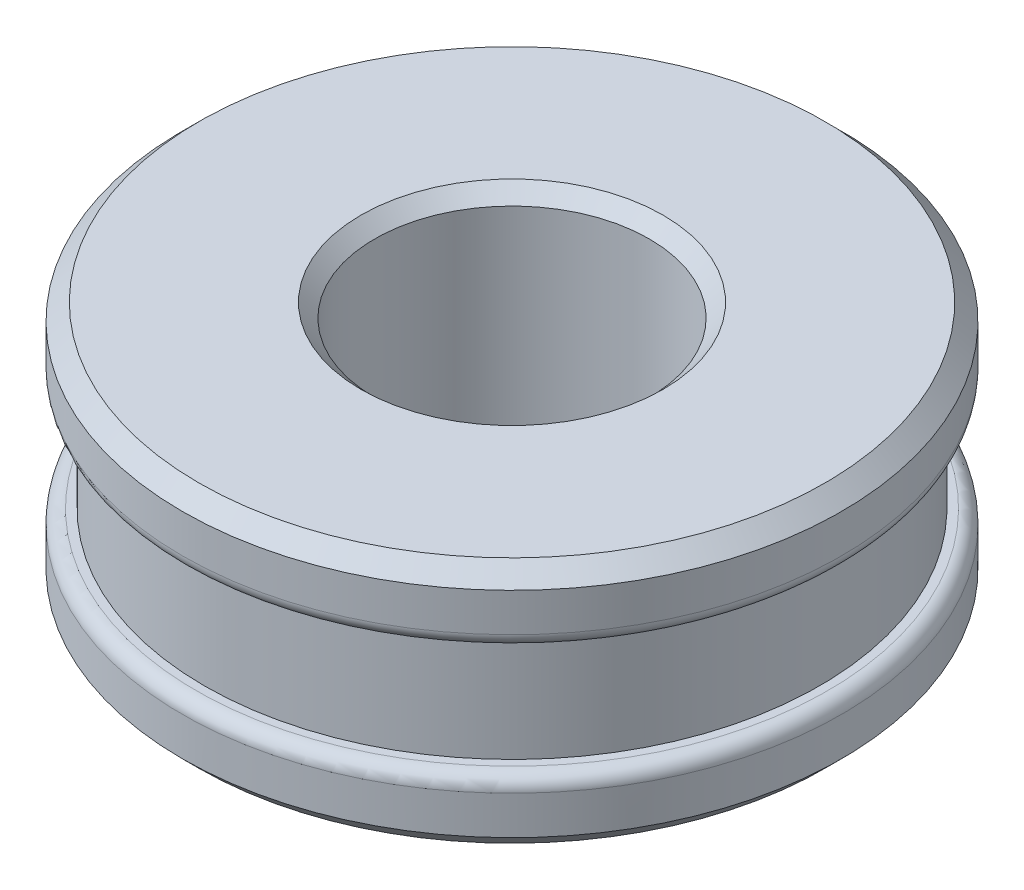
ISO-10303-21;
HEADER;
FILE_DESCRIPTION(('STEP AP214'),'2;1');
FILE_NAME('part.step','',(''),(''),'','','');
FILE_SCHEMA(('AUTOMOTIVE_DESIGN { 1 0 10303 214 1 1 1 1 }'));
ENDSEC;
DATA;
#1=APPLICATION_CONTEXT('core data for automotive mechanical design processes');
#2=APPLICATION_PROTOCOL_DEFINITION('international standard','automotive_design',2000,#1);
#3=PRODUCT_CONTEXT('',#1,'mechanical');
#4=PRODUCT('Part','Part','',(#3));
#5=PRODUCT_RELATED_PRODUCT_CATEGORY('part','',(#4));
#6=PRODUCT_DEFINITION_FORMATION('','',#4);
#7=PRODUCT_DEFINITION_CONTEXT('part definition',#1,'design');
#8=PRODUCT_DEFINITION('design','',#6,#7);
#9=PRODUCT_DEFINITION_SHAPE('','',#8);
#10=(LENGTH_UNIT() NAMED_UNIT(*) SI_UNIT(.MILLI.,.METRE.));
#11=(NAMED_UNIT(*) PLANE_ANGLE_UNIT() SI_UNIT($,.RADIAN.));
#12=(NAMED_UNIT(*) SI_UNIT($,.STERADIAN.) SOLID_ANGLE_UNIT());
#13=UNCERTAINTY_MEASURE_WITH_UNIT(LENGTH_MEASURE(1.E-05),#10,'distance_accuracy_value','');
#14=(GEOMETRIC_REPRESENTATION_CONTEXT(3) GLOBAL_UNCERTAINTY_ASSIGNED_CONTEXT((#13)) GLOBAL_UNIT_ASSIGNED_CONTEXT((#10,
#11,#12)) REPRESENTATION_CONTEXT('',''));
#15=CARTESIAN_POINT('',(0.,0.,0.));
#16=DIRECTION('',(0.,0.,1.));
#17=DIRECTION('',(1.,0.,0.));
#18=AXIS2_PLACEMENT_3D('',#15,#16,#17);
#19=CARTESIAN_POINT('',(0.,9.,0.));
#20=DIRECTION('',(0.,-1.,0.));
#21=DIRECTION('',(0.,0.,-1.));
#22=AXIS2_PLACEMENT_3D('',#19,#20,#21);
#23=CYLINDRICAL_SURFACE('',#22,12.);
#24=CARTESIAN_POINT('',(0.,2.,0.));
#25=DIRECTION('',(0.,-1.,0.));
#26=DIRECTION('',(0.,0.,-1.));
#27=AXIS2_PLACEMENT_3D('',#24,#25,#26);
#28=CIRCLE('',#27,12.);
#29=CARTESIAN_POINT('',(0.,2.,-12.));
#30=VERTEX_POINT('',#29);
#31=EDGE_CURVE('E68',#30,#30,#28,.T.);
#32=ORIENTED_EDGE('',*,*,#31,.T.);
#33=EDGE_LOOP('',(#32));
#34=FACE_BOUND('',#33,.T.);
#35=CARTESIAN_POINT('',(0.,0.599999999999998,0.));
#36=DIRECTION('',(0.,1.,0.));
#37=DIRECTION('',(0.,0.,1.));
#38=AXIS2_PLACEMENT_3D('',#35,#36,#37);
#39=CIRCLE('',#38,12.);
#40=CARTESIAN_POINT('',(0.,0.599999999999998,12.));
#41=VERTEX_POINT('',#40);
#42=EDGE_CURVE('E88',#41,#41,#39,.T.);
#43=ORIENTED_EDGE('',*,*,#42,.T.);
#44=EDGE_LOOP('',(#43));
#45=FACE_BOUND('',#44,.T.);
#46=ADVANCED_FACE('F39',(#34,#45),#23,.T.);
#47=CARTESIAN_POINT('',(0.,9.,0.));
#48=DIRECTION('',(0.,1.,0.));
#49=DIRECTION('',(0.,0.,1.));
#50=AXIS2_PLACEMENT_3D('',#47,#48,#49);
#51=PLANE('',#50);
#52=CARTESIAN_POINT('',(0.,9.,0.));
#53=DIRECTION('',(0.,1.,0.));
#54=DIRECTION('',(0.,0.,1.));
#55=AXIS2_PLACEMENT_3D('',#52,#53,#54);
#56=CIRCLE('',#55,5.50000000000001);
#57=CARTESIAN_POINT('',(0.,9.,5.50000000000001));
#58=VERTEX_POINT('',#57);
#59=EDGE_CURVE('E10',#58,#58,#56,.F.);
#60=ORIENTED_EDGE('',*,*,#59,.T.);
#61=EDGE_LOOP('',(#60));
#62=FACE_BOUND('',#61,.T.);
#63=CARTESIAN_POINT('',(0.,9.,0.));
#64=DIRECTION('',(0.,1.,0.));
#65=DIRECTION('',(0.,0.,1.));
#66=AXIS2_PLACEMENT_3D('',#63,#64,#65);
#67=CIRCLE('',#66,11.4);
#68=CARTESIAN_POINT('',(0.,9.,11.4));
#69=VERTEX_POINT('',#68);
#70=EDGE_CURVE('E80',#69,#69,#67,.T.);
#71=ORIENTED_EDGE('',*,*,#70,.T.);
#72=EDGE_LOOP('',(#71));
#73=FACE_BOUND('',#72,.T.);
#74=ADVANCED_FACE('F123',(#62,#73),#51,.T.);
#75=CARTESIAN_POINT('',(0.,0.,0.));
#76=DIRECTION('',(0.,1.,0.));
#77=DIRECTION('',(0.,0.,1.));
#78=AXIS2_PLACEMENT_3D('',#75,#76,#77);
#79=PLANE('',#78);
#80=CARTESIAN_POINT('',(0.,0.,0.));
#81=DIRECTION('',(0.,1.,0.));
#82=DIRECTION('',(0.,0.,1.));
#83=AXIS2_PLACEMENT_3D('',#80,#81,#82);
#84=CIRCLE('',#83,5.5);
#85=CARTESIAN_POINT('',(0.,0.,5.5));
#86=VERTEX_POINT('',#85);
#87=EDGE_CURVE('E58',#86,#86,#84,.T.);
#88=ORIENTED_EDGE('',*,*,#87,.T.);
#89=EDGE_LOOP('',(#88));
#90=FACE_BOUND('',#89,.T.);
#91=CARTESIAN_POINT('',(0.,0.,0.));
#92=DIRECTION('',(0.,1.,0.));
#93=DIRECTION('',(0.,0.,1.));
#94=AXIS2_PLACEMENT_3D('',#91,#92,#93);
#95=CIRCLE('',#94,11.4);
#96=CARTESIAN_POINT('',(0.,0.,11.4));
#97=VERTEX_POINT('',#96);
#98=EDGE_CURVE('E84',#97,#97,#95,.F.);
#99=ORIENTED_EDGE('',*,*,#98,.T.);
#100=EDGE_LOOP('',(#99));
#101=FACE_BOUND('',#100,.T.);
#102=ADVANCED_FACE('F130',(#90,#101),#79,.F.);
#103=CARTESIAN_POINT('',(0.,7.,0.));
#104=DIRECTION('',(0.,1.,0.));
#105=DIRECTION('',(0.,0.,1.));
#106=AXIS2_PLACEMENT_3D('',#103,#104,#105);
#107=CIRCLE('',#106,12.);
#108=CARTESIAN_POINT('',(0.,7.,12.));
#109=VERTEX_POINT('',#108);
#110=EDGE_CURVE('E72',#109,#109,#107,.T.);
#111=ORIENTED_EDGE('',*,*,#110,.T.);
#112=EDGE_LOOP('',(#111));
#113=FACE_BOUND('',#112,.T.);
#114=CARTESIAN_POINT('',(0.,8.4,0.));
#115=DIRECTION('',(0.,1.,0.));
#116=DIRECTION('',(0.,0.,1.));
#117=AXIS2_PLACEMENT_3D('',#114,#115,#116);
#118=CIRCLE('',#117,12.);
#119=CARTESIAN_POINT('',(0.,8.4,12.));
#120=VERTEX_POINT('',#119);
#121=EDGE_CURVE('E92',#120,#120,#118,.F.);
#122=ORIENTED_EDGE('',*,*,#121,.T.);
#123=EDGE_LOOP('',(#122));
#124=FACE_BOUND('',#123,.T.);
#125=ADVANCED_FACE('F126',(#113,#124),#23,.T.);
#126=CARTESIAN_POINT('',(0.,9.,0.));
#127=DIRECTION('',(0.,-1.,0.));
#128=DIRECTION('',(0.,0.,-1.));
#129=AXIS2_PLACEMENT_3D('',#126,#127,#128);
#130=CYLINDRICAL_SURFACE('',#129,5.);
#131=CARTESIAN_POINT('',(0.,0.499999999999999,0.));
#132=DIRECTION('',(0.,1.,0.));
#133=DIRECTION('',(0.,0.,1.));
#134=AXIS2_PLACEMENT_3D('',#131,#132,#133);
#135=CIRCLE('',#134,5.);
#136=CARTESIAN_POINT('',(0.,0.499999999999999,5.));
#137=VERTEX_POINT('',#136);
#138=EDGE_CURVE('E48',#137,#137,#135,.F.);
#139=ORIENTED_EDGE('',*,*,#138,.T.);
#140=EDGE_LOOP('',(#139));
#141=FACE_BOUND('',#140,.T.);
#142=CARTESIAN_POINT('',(0.,8.5,0.));
#143=DIRECTION('',(0.,1.,0.));
#144=DIRECTION('',(0.,0.,1.));
#145=AXIS2_PLACEMENT_3D('',#142,#143,#144);
#146=CIRCLE('',#145,5.);
#147=CARTESIAN_POINT('',(0.,8.5,5.));
#148=VERTEX_POINT('',#147);
#149=EDGE_CURVE('E53',#148,#148,#146,.T.);
#150=ORIENTED_EDGE('',*,*,#149,.T.);
#151=EDGE_LOOP('',(#150));
#152=FACE_BOUND('',#151,.T.);
#153=ADVANCED_FACE('F136',(#141,#152),#130,.F.);
#154=CARTESIAN_POINT('',(0.,0.599999999999998,0.));
#155=DIRECTION('',(0.,1.,0.));
#156=DIRECTION('',(0.,0.,1.));
#157=AXIS2_PLACEMENT_3D('',#154,#155,#156);
#158=CONICAL_SURFACE('',#157,12.,0.785398163397451);
#159=ORIENTED_EDGE('',*,*,#98,.F.);
#160=EDGE_LOOP('',(#159));
#161=FACE_BOUND('',#160,.T.);
#162=ORIENTED_EDGE('',*,*,#42,.F.);
#163=EDGE_LOOP('',(#162));
#164=FACE_BOUND('',#163,.T.);
#165=ADVANCED_FACE('F142',(#161,#164),#158,.T.);
#166=CARTESIAN_POINT('',(0.,9.,0.));
#167=DIRECTION('',(0.,-1.,0.));
#168=DIRECTION('',(0.,0.,-1.));
#169=AXIS2_PLACEMENT_3D('',#166,#167,#168);
#170=CONICAL_SURFACE('',#169,11.4,0.785398163397451);
#171=ORIENTED_EDGE('',*,*,#121,.F.);
#172=EDGE_LOOP('',(#171));
#173=FACE_BOUND('',#172,.T.);
#174=ORIENTED_EDGE('',*,*,#70,.F.);
#175=EDGE_LOOP('',(#174));
#176=FACE_BOUND('',#175,.T.);
#177=ADVANCED_FACE('F149',(#173,#176),#170,.T.);
#178=CARTESIAN_POINT('',(11.2,2.5,0.));
#179=DIRECTION('',(0.,-1.,0.));
#180=DIRECTION('',(0.,0.,-1.));
#181=AXIS2_PLACEMENT_3D('',#178,#179,#180);
#182=PLANE('',#181);
#183=CARTESIAN_POINT('',(0.,2.5,0.));
#184=DIRECTION('',(0.,-1.,0.));
#185=DIRECTION('',(0.,0.,-1.));
#186=AXIS2_PLACEMENT_3D('',#183,#184,#185);
#187=CIRCLE('',#186,11.5);
#188=CARTESIAN_POINT('',(0.,2.5,-11.5));
#189=VERTEX_POINT('',#188);
#190=EDGE_CURVE('E64',#189,#189,#187,.F.);
#191=ORIENTED_EDGE('',*,*,#190,.T.);
#192=EDGE_LOOP('',(#191));
#193=FACE_BOUND('',#192,.T.);
#194=CARTESIAN_POINT('',(0.,2.5,0.));
#195=DIRECTION('',(0.,-1.,0.));
#196=DIRECTION('',(0.,0.,-1.));
#197=AXIS2_PLACEMENT_3D('',#194,#195,#196);
#198=CIRCLE('',#197,11.2);
#199=CARTESIAN_POINT('',(0.,2.5,-11.2));
#200=VERTEX_POINT('',#199);
#201=EDGE_CURVE('E96',#200,#200,#198,.T.);
#202=ORIENTED_EDGE('',*,*,#201,.T.);
#203=EDGE_LOOP('',(#202));
#204=FACE_BOUND('',#203,.T.);
#205=ADVANCED_FACE('F119',(#193,#204),#182,.F.);
#206=CARTESIAN_POINT('',(0.,0.,0.));
#207=DIRECTION('',(0.,-1.,0.));
#208=DIRECTION('',(0.,0.,-1.));
#209=AXIS2_PLACEMENT_3D('',#206,#207,#208);
#210=CYLINDRICAL_SURFACE('',#209,11.2);
#211=ORIENTED_EDGE('',*,*,#201,.F.);
#212=EDGE_LOOP('',(#211));
#213=FACE_BOUND('',#212,.T.);
#214=CARTESIAN_POINT('',(0.,6.5,0.));
#215=DIRECTION('',(0.,-1.,0.));
#216=DIRECTION('',(0.,0.,-1.));
#217=AXIS2_PLACEMENT_3D('',#214,#215,#216);
#218=CIRCLE('',#217,11.2);
#219=CARTESIAN_POINT('',(0.,6.5,-11.2));
#220=VERTEX_POINT('',#219);
#221=EDGE_CURVE('E100',#220,#220,#218,.T.);
#222=ORIENTED_EDGE('',*,*,#221,.T.);
#223=EDGE_LOOP('',(#222));
#224=FACE_BOUND('',#223,.T.);
#225=ADVANCED_FACE('F105',(#213,#224),#210,.T.);
#226=CARTESIAN_POINT('',(12.,6.5,0.));
#227=DIRECTION('',(0.,1.,0.));
#228=DIRECTION('',(0.,0.,1.));
#229=AXIS2_PLACEMENT_3D('',#226,#227,#228);
#230=PLANE('',#229);
#231=CARTESIAN_POINT('',(0.,6.5,0.));
#232=DIRECTION('',(0.,1.,0.));
#233=DIRECTION('',(0.,0.,1.));
#234=AXIS2_PLACEMENT_3D('',#231,#232,#233);
#235=CIRCLE('',#234,11.5);
#236=CARTESIAN_POINT('',(0.,6.5,11.5));
#237=VERTEX_POINT('',#236);
#238=EDGE_CURVE('E76',#237,#237,#235,.F.);
#239=ORIENTED_EDGE('',*,*,#238,.T.);
#240=EDGE_LOOP('',(#239));
#241=FACE_BOUND('',#240,.T.);
#242=ORIENTED_EDGE('',*,*,#221,.F.);
#243=EDGE_LOOP('',(#242));
#244=FACE_BOUND('',#243,.T.);
#245=ADVANCED_FACE('F107',(#241,#244),#230,.F.);
#246=CARTESIAN_POINT('',(0.,7.,0.));
#247=DIRECTION('',(0.,1.,0.));
#248=DIRECTION('',(0.,0.,1.));
#249=AXIS2_PLACEMENT_3D('',#246,#247,#248);
#250=TOROIDAL_SURFACE('',#249,11.5,0.5);
#251=ORIENTED_EDGE('',*,*,#110,.F.);
#252=EDGE_LOOP('',(#251));
#253=FACE_BOUND('',#252,.T.);
#254=ORIENTED_EDGE('',*,*,#238,.F.);
#255=EDGE_LOOP('',(#254));
#256=FACE_BOUND('',#255,.T.);
#257=ADVANCED_FACE('F109',(#253,#256),#250,.T.);
#258=CARTESIAN_POINT('',(0.,2.,0.));
#259=DIRECTION('',(0.,-1.,0.));
#260=DIRECTION('',(0.,0.,-1.));
#261=AXIS2_PLACEMENT_3D('',#258,#259,#260);
#262=TOROIDAL_SURFACE('',#261,11.5,0.5);
#263=ORIENTED_EDGE('',*,*,#190,.F.);
#264=EDGE_LOOP('',(#263));
#265=FACE_BOUND('',#264,.T.);
#266=ORIENTED_EDGE('',*,*,#31,.F.);
#267=EDGE_LOOP('',(#266));
#268=FACE_BOUND('',#267,.T.);
#269=ADVANCED_FACE('F116',(#265,#268),#262,.T.);
#270=CARTESIAN_POINT('',(0.,0.,0.));
#271=DIRECTION('',(0.,-1.,0.));
#272=DIRECTION('',(0.,0.,-1.));
#273=AXIS2_PLACEMENT_3D('',#270,#271,#272);
#274=CONICAL_SURFACE('',#273,5.5,0.785398163397447);
#275=ORIENTED_EDGE('',*,*,#138,.F.);
#276=EDGE_LOOP('',(#275));
#277=FACE_BOUND('',#276,.T.);
#278=ORIENTED_EDGE('',*,*,#87,.F.);
#279=EDGE_LOOP('',(#278));
#280=FACE_BOUND('',#279,.T.);
#281=ADVANCED_FACE('F169',(#277,#280),#274,.F.);
#282=CARTESIAN_POINT('',(0.,8.5,0.));
#283=DIRECTION('',(0.,1.,0.));
#284=DIRECTION('',(0.,0.,1.));
#285=AXIS2_PLACEMENT_3D('',#282,#283,#284);
#286=CONICAL_SURFACE('',#285,5.,0.785398163397453);
#287=ORIENTED_EDGE('',*,*,#59,.F.);
#288=EDGE_LOOP('',(#287));
#289=FACE_BOUND('',#288,.T.);
#290=ORIENTED_EDGE('',*,*,#149,.F.);
#291=EDGE_LOOP('',(#290));
#292=FACE_BOUND('',#291,.T.);
#293=ADVANCED_FACE('F42',(#289,#292),#286,.F.);
#294=CLOSED_SHELL('',(#46,#74,#102,#125,#153,#165,#177,#205,#225,#245,#257,#269,#281,#293));
#295=MANIFOLD_SOLID_BREP('B2',#294);
#296=ADVANCED_BREP_SHAPE_REPRESENTATION('',(#18,#295),#14);
#297=SHAPE_DEFINITION_REPRESENTATION(#9,#296);
ENDSEC;
END-ISO-10303-21;
